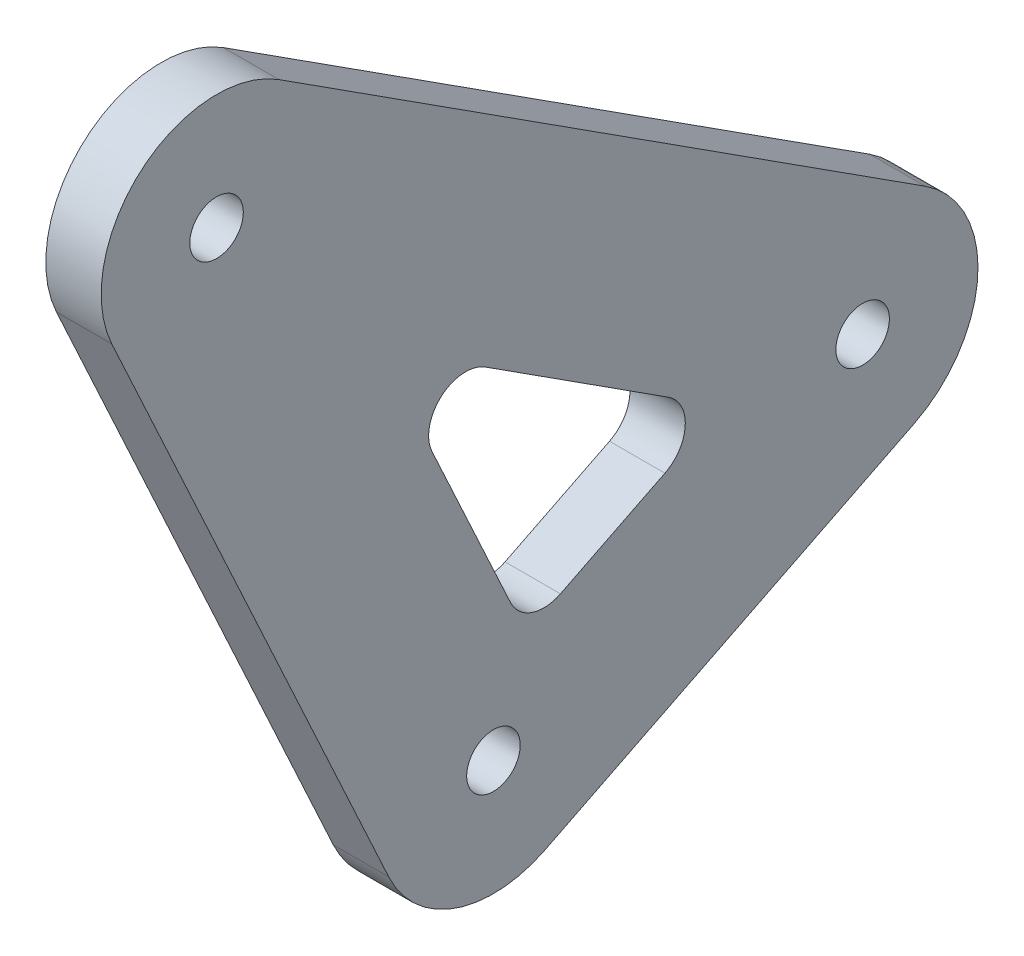
ISO-10303-21;
HEADER;
FILE_DESCRIPTION(('STEP AP214'),'2;1');
FILE_NAME('part.step','',(''),(''),'','','');
FILE_SCHEMA(('AUTOMOTIVE_DESIGN { 1 0 10303 214 1 1 1 1 }'));
ENDSEC;
DATA;
#1=APPLICATION_CONTEXT('core data for automotive mechanical design processes');
#2=APPLICATION_PROTOCOL_DEFINITION('international standard','automotive_design',2000,#1);
#3=PRODUCT_CONTEXT('',#1,'mechanical');
#4=PRODUCT('Part','Part','',(#3));
#5=PRODUCT_RELATED_PRODUCT_CATEGORY('part','',(#4));
#6=PRODUCT_DEFINITION_FORMATION('','',#4);
#7=PRODUCT_DEFINITION_CONTEXT('part definition',#1,'design');
#8=PRODUCT_DEFINITION('design','',#6,#7);
#9=PRODUCT_DEFINITION_SHAPE('','',#8);
#10=(LENGTH_UNIT() NAMED_UNIT(*) SI_UNIT(.MILLI.,.METRE.));
#11=(NAMED_UNIT(*) PLANE_ANGLE_UNIT() SI_UNIT($,.RADIAN.));
#12=(NAMED_UNIT(*) SI_UNIT($,.STERADIAN.) SOLID_ANGLE_UNIT());
#13=UNCERTAINTY_MEASURE_WITH_UNIT(LENGTH_MEASURE(1.E-05),#10,'distance_accuracy_value','');
#14=(GEOMETRIC_REPRESENTATION_CONTEXT(3) GLOBAL_UNCERTAINTY_ASSIGNED_CONTEXT((#13)) GLOBAL_UNIT_ASSIGNED_CONTEXT((#10,
#11,#12)) REPRESENTATION_CONTEXT('',''));
#15=CARTESIAN_POINT('',(0.,0.,0.));
#16=DIRECTION('',(0.,0.,1.));
#17=DIRECTION('',(1.,0.,0.));
#18=AXIS2_PLACEMENT_3D('',#15,#16,#17);
#19=CARTESIAN_POINT('',(1.5,10.000000011185,-20.));
#20=DIRECTION('',(-1.,0.,0.));
#21=DIRECTION('',(0.,0.,1.));
#22=AXIS2_PLACEMENT_3D('',#19,#20,#21);
#23=CYLINDRICAL_SURFACE('',#22,6.25);
#24=CARTESIAN_POINT('',(-1.5,10.000000011185,-20.));
#25=DIRECTION('',(1.,0.,0.));
#26=DIRECTION('',(0.,0.,-1.));
#27=AXIS2_PLACEMENT_3D('',#24,#25,#26);
#28=CIRCLE('',#27,6.25);
#29=CARTESIAN_POINT('',(-1.5,4.4098300686861,-22.7950849743758));
#30=VERTEX_POINT('',#29);
#31=CARTESIAN_POINT('',(-1.5,15.2573654830527,-23.3797349445205));
#32=VERTEX_POINT('',#31);
#33=EDGE_CURVE('E202',#30,#32,#28,.T.);
#34=ORIENTED_EDGE('',*,*,#33,.T.);
#35=DIRECTION('',(-1.,0.,0.));
#36=VECTOR('',#35,1.);
#37=CARTESIAN_POINT('',(1.5,15.2573654830527,-23.3797349445205));
#38=LINE('',#37,#36);
#39=CARTESIAN_POINT('',(1.5,15.2573654830527,-23.3797349445205));
#40=VERTEX_POINT('',#39);
#41=EDGE_CURVE('E11',#40,#32,#38,.T.);
#42=ORIENTED_EDGE('',*,*,#41,.F.);
#43=CARTESIAN_POINT('',(1.5,10.000000011185,-20.));
#44=DIRECTION('',(1.,0.,0.));
#45=DIRECTION('',(0.,0.,-1.));
#46=AXIS2_PLACEMENT_3D('',#43,#44,#45);
#47=CIRCLE('',#46,6.25);
#48=CARTESIAN_POINT('',(1.5,4.4098300686861,-22.7950849743758));
#49=VERTEX_POINT('',#48);
#50=EDGE_CURVE('E179',#49,#40,#47,.T.);
#51=ORIENTED_EDGE('',*,*,#50,.F.);
#52=DIRECTION('',(-1.,0.,0.));
#53=VECTOR('',#52,1.);
#54=CARTESIAN_POINT('',(1.5,4.4098300686861,-22.7950849743758));
#55=LINE('',#54,#53);
#56=EDGE_CURVE('E199',#49,#30,#55,.T.);
#57=ORIENTED_EDGE('',*,*,#56,.T.);
#58=EDGE_LOOP('',(#34,#42,#51,#57));
#59=FACE_BOUND('',#58,.T.);
#60=ADVANCED_FACE('F35',(#59),#23,.T.);
#61=CARTESIAN_POINT('',(1.5,21.4306506785176,-13.7768468579126));
#62=DIRECTION('',(0.,0.841178475498832,-0.540757591123288));
#63=DIRECTION('',(0.,0.540757591123288,0.841178475498832));
#64=AXIS2_PLACEMENT_3D('',#61,#62,#63);
#65=PLANE('',#64);
#66=DIRECTION('',(0.,-0.540757591123288,-0.841178475498832));
#67=VECTOR('',#66,1.);
#68=CARTESIAN_POINT('',(-1.5,21.4306506785176,-13.7768468579126));
#69=LINE('',#68,#67);
#70=CARTESIAN_POINT('',(-1.5,37.7573654718677,11.6202650554795));
#71=VERTEX_POINT('',#70);
#72=EDGE_CURVE('E205',#71,#32,#69,.T.);
#73=ORIENTED_EDGE('',*,*,#72,.F.);
#74=DIRECTION('',(-1.,0.,0.));
#75=VECTOR('',#74,1.);
#76=CARTESIAN_POINT('',(1.5,37.7573654718677,11.6202650554795));
#77=LINE('',#76,#75);
#78=CARTESIAN_POINT('',(1.5,37.7573654718677,11.6202650554795));
#79=VERTEX_POINT('',#78);
#80=EDGE_CURVE('E43',#79,#71,#77,.T.);
#81=ORIENTED_EDGE('',*,*,#80,.F.);
#82=DIRECTION('',(0.,-0.540757591123288,-0.841178475498832));
#83=VECTOR('',#82,1.);
#84=CARTESIAN_POINT('',(1.5,21.4306506785176,-13.7768468579126));
#85=LINE('',#84,#83);
#86=EDGE_CURVE('E182',#79,#40,#85,.T.);
#87=ORIENTED_EDGE('',*,*,#86,.T.);
#88=ORIENTED_EDGE('',*,*,#41,.T.);
#89=EDGE_LOOP('',(#73,#81,#87,#88));
#90=FACE_BOUND('',#89,.T.);
#91=ADVANCED_FACE('F244',(#90),#65,.T.);
#92=CARTESIAN_POINT('',(1.5,32.5,15.));
#93=DIRECTION('',(-1.,0.,0.));
#94=DIRECTION('',(0.,0.,1.));
#95=AXIS2_PLACEMENT_3D('',#92,#93,#94);
#96=CYLINDRICAL_SURFACE('',#95,6.25);
#97=CARTESIAN_POINT('',(-1.5,32.5,15.));
#98=DIRECTION('',(1.,0.,0.));
#99=DIRECTION('',(0.,0.,-1.));
#100=AXIS2_PLACEMENT_3D('',#97,#98,#99);
#101=CIRCLE('',#100,6.25);
#102=CARTESIAN_POINT('',(-1.5,29.8808863908641,20.6747461531278));
#103=VERTEX_POINT('',#102);
#104=EDGE_CURVE('E208',#71,#103,#101,.T.);
#105=ORIENTED_EDGE('',*,*,#104,.T.);
#106=DIRECTION('',(-1.,0.,0.));
#107=VECTOR('',#106,1.);
#108=CARTESIAN_POINT('',(1.5,29.8808863908641,20.6747461531278));
#109=LINE('',#108,#107);
#110=CARTESIAN_POINT('',(1.5,29.8808863908641,20.6747461531278));
#111=VERTEX_POINT('',#110);
#112=EDGE_CURVE('E229',#111,#103,#109,.T.);
#113=ORIENTED_EDGE('',*,*,#112,.F.);
#114=CARTESIAN_POINT('',(1.5,32.5,15.));
#115=DIRECTION('',(1.,0.,0.));
#116=DIRECTION('',(0.,0.,-1.));
#117=AXIS2_PLACEMENT_3D('',#114,#115,#116);
#118=CIRCLE('',#117,6.25);
#119=EDGE_CURVE('E185',#79,#111,#118,.T.);
#120=ORIENTED_EDGE('',*,*,#119,.F.);
#121=ORIENTED_EDGE('',*,*,#80,.T.);
#122=EDGE_LOOP('',(#105,#113,#120,#121));
#123=FACE_BOUND('',#122,.T.);
#124=ADVANCED_FACE('F234',(#123),#96,.T.);
#125=CARTESIAN_POINT('',(1.5,-2.61911360913592,5.67474615312783));
#126=DIRECTION('',(0.,0.419058177461747,-0.907959384500452));
#127=DIRECTION('',(0.,0.907959384500452,0.419058177461747));
#128=AXIS2_PLACEMENT_3D('',#125,#126,#127);
#129=PLANE('',#128);
#130=DIRECTION('',(0.,-0.907959384500452,-0.419058177461747));
#131=VECTOR('',#130,1.);
#132=CARTESIAN_POINT('',(-1.5,-2.61911360913592,5.67474615312783));
#133=LINE('',#132,#131);
#134=CARTESIAN_POINT('',(-1.5,-2.61911360913592,5.67474615312783));
#135=VERTEX_POINT('',#134);
#136=EDGE_CURVE('E210',#103,#135,#133,.T.);
#137=ORIENTED_EDGE('',*,*,#136,.T.);
#138=DIRECTION('',(-1.,0.,0.));
#139=VECTOR('',#138,1.);
#140=CARTESIAN_POINT('',(1.5,-2.61911360913592,5.67474615312783));
#141=LINE('',#140,#139);
#142=CARTESIAN_POINT('',(1.5,-2.61911360913592,5.67474615312783));
#143=VERTEX_POINT('',#142);
#144=EDGE_CURVE('E226',#143,#135,#141,.T.);
#145=ORIENTED_EDGE('',*,*,#144,.F.);
#146=DIRECTION('',(0.,-0.907959384500452,-0.419058177461747));
#147=VECTOR('',#146,1.);
#148=CARTESIAN_POINT('',(1.5,-2.61911360913592,5.67474615312783));
#149=LINE('',#148,#147);
#150=EDGE_CURVE('E187',#111,#143,#149,.T.);
#151=ORIENTED_EDGE('',*,*,#150,.F.);
#152=ORIENTED_EDGE('',*,*,#112,.T.);
#153=EDGE_LOOP('',(#137,#145,#151,#152));
#154=FACE_BOUND('',#153,.T.);
#155=ADVANCED_FACE('F260',(#154),#129,.F.);
#156=CARTESIAN_POINT('',(1.5,0.,0.));
#157=DIRECTION('',(-1.,0.,0.));
#158=DIRECTION('',(0.,0.,1.));
#159=AXIS2_PLACEMENT_3D('',#156,#157,#158);
#160=CYLINDRICAL_SURFACE('',#159,6.25);
#161=CARTESIAN_POINT('',(-1.5,0.,0.));
#162=DIRECTION('',(1.,0.,0.));
#163=DIRECTION('',(0.,0.,-1.));
#164=AXIS2_PLACEMENT_3D('',#161,#162,#163);
#165=CIRCLE('',#164,6.25);
#166=CARTESIAN_POINT('',(-1.5,-5.59016994249895,-2.79508497437579));
#167=VERTEX_POINT('',#166);
#168=EDGE_CURVE('E212',#135,#167,#165,.T.);
#169=ORIENTED_EDGE('',*,*,#168,.T.);
#170=DIRECTION('',(-1.,0.,0.));
#171=VECTOR('',#170,1.);
#172=CARTESIAN_POINT('',(1.5,-5.59016994249895,-2.79508497437579));
#173=LINE('',#172,#171);
#174=CARTESIAN_POINT('',(1.5,-5.59016994249895,-2.79508497437579));
#175=VERTEX_POINT('',#174);
#176=EDGE_CURVE('E223',#175,#167,#173,.T.);
#177=ORIENTED_EDGE('',*,*,#176,.F.);
#178=CARTESIAN_POINT('',(1.5,0.,0.));
#179=DIRECTION('',(1.,0.,0.));
#180=DIRECTION('',(0.,0.,-1.));
#181=AXIS2_PLACEMENT_3D('',#178,#179,#180);
#182=CIRCLE('',#181,6.25);
#183=EDGE_CURVE('E189',#143,#175,#182,.T.);
#184=ORIENTED_EDGE('',*,*,#183,.F.);
#185=ORIENTED_EDGE('',*,*,#144,.T.);
#186=EDGE_LOOP('',(#169,#177,#184,#185));
#187=FACE_BOUND('',#186,.T.);
#188=ADVANCED_FACE('F256',(#187),#160,.T.);
#189=CARTESIAN_POINT('',(1.5,32.5,15.));
#190=DIRECTION('',(-1.,0.,0.));
#191=DIRECTION('',(0.,0.,1.));
#192=AXIS2_PLACEMENT_3D('',#189,#190,#191);
#193=CYLINDRICAL_SURFACE('',#192,1.45);
#194=CARTESIAN_POINT('',(1.5,32.5,15.));
#195=DIRECTION('',(1.,0.,0.));
#196=DIRECTION('',(0.,0.,-1.));
#197=AXIS2_PLACEMENT_3D('',#194,#195,#196);
#198=CIRCLE('',#197,1.45);
#199=CARTESIAN_POINT('',(1.5,32.5,13.55));
#200=VERTEX_POINT('',#199);
#201=EDGE_CURVE('E193',#200,#200,#198,.T.);
#202=ORIENTED_EDGE('',*,*,#201,.T.);
#203=EDGE_LOOP('',(#202));
#204=FACE_BOUND('',#203,.T.);
#205=CARTESIAN_POINT('',(-1.5,32.5,15.));
#206=DIRECTION('',(1.,0.,0.));
#207=DIRECTION('',(0.,0.,-1.));
#208=AXIS2_PLACEMENT_3D('',#205,#206,#207);
#209=CIRCLE('',#208,1.45);
#210=CARTESIAN_POINT('',(-1.5,32.5,13.55));
#211=VERTEX_POINT('',#210);
#212=EDGE_CURVE('E216',#211,#211,#209,.T.);
#213=ORIENTED_EDGE('',*,*,#212,.F.);
#214=EDGE_LOOP('',(#213));
#215=FACE_BOUND('',#214,.T.);
#216=ADVANCED_FACE('F296',(#204,#215),#193,.F.);
#217=CARTESIAN_POINT('',(1.5,-5.59016994249895,-2.79508497437579));
#218=DIRECTION('',(0.,0.894427190799832,0.447213595900126));
#219=DIRECTION('',(0.,-0.447213595900126,0.894427190799832));
#220=AXIS2_PLACEMENT_3D('',#217,#218,#219);
#221=PLANE('',#220);
#222=DIRECTION('',(0.,0.447213595900126,-0.894427190799832));
#223=VECTOR('',#222,1.);
#224=CARTESIAN_POINT('',(-1.5,-5.59016994249895,-2.79508497437579));
#225=LINE('',#224,#223);
#226=EDGE_CURVE('E214',#167,#30,#225,.T.);
#227=ORIENTED_EDGE('',*,*,#226,.T.);
#228=ORIENTED_EDGE('',*,*,#56,.F.);
#229=DIRECTION('',(0.,0.447213595900126,-0.894427190799832));
#230=VECTOR('',#229,1.);
#231=CARTESIAN_POINT('',(1.5,-5.59016994249895,-2.79508497437579));
#232=LINE('',#231,#230);
#233=EDGE_CURVE('E191',#175,#49,#232,.T.);
#234=ORIENTED_EDGE('',*,*,#233,.F.);
#235=ORIENTED_EDGE('',*,*,#176,.T.);
#236=EDGE_LOOP('',(#227,#228,#234,#235));
#237=FACE_BOUND('',#236,.T.);
#238=ADVANCED_FACE('F251',(#237),#221,.F.);
#239=CARTESIAN_POINT('',(1.5,10.000000011185,-20.));
#240=DIRECTION('',(-1.,0.,0.));
#241=DIRECTION('',(0.,0.,1.));
#242=AXIS2_PLACEMENT_3D('',#239,#240,#241);
#243=CYLINDRICAL_SURFACE('',#242,1.45);
#244=CARTESIAN_POINT('',(1.5,10.000000011185,-20.));
#245=DIRECTION('',(1.,0.,0.));
#246=DIRECTION('',(0.,0.,-1.));
#247=AXIS2_PLACEMENT_3D('',#244,#245,#246);
#248=CIRCLE('',#247,1.45);
#249=CARTESIAN_POINT('',(1.5,10.000000011185,-21.45));
#250=VERTEX_POINT('',#249);
#251=EDGE_CURVE('E176',#250,#250,#248,.T.);
#252=ORIENTED_EDGE('',*,*,#251,.T.);
#253=EDGE_LOOP('',(#252));
#254=FACE_BOUND('',#253,.T.);
#255=CARTESIAN_POINT('',(-1.5,10.000000011185,-20.));
#256=DIRECTION('',(1.,0.,0.));
#257=DIRECTION('',(0.,0.,-1.));
#258=AXIS2_PLACEMENT_3D('',#255,#256,#257);
#259=CIRCLE('',#258,1.45);
#260=CARTESIAN_POINT('',(-1.5,10.000000011185,-21.45));
#261=VERTEX_POINT('',#260);
#262=EDGE_CURVE('E168',#261,#261,#259,.T.);
#263=ORIENTED_EDGE('',*,*,#262,.F.);
#264=EDGE_LOOP('',(#263));
#265=FACE_BOUND('',#264,.T.);
#266=ADVANCED_FACE('F37',(#254,#265),#243,.F.);
#267=CARTESIAN_POINT('',(1.5,0.,0.));
#268=DIRECTION('',(-1.,0.,0.));
#269=DIRECTION('',(0.,0.,1.));
#270=AXIS2_PLACEMENT_3D('',#267,#268,#269);
#271=CYLINDRICAL_SURFACE('',#270,1.45);
#272=CARTESIAN_POINT('',(1.5,0.,0.));
#273=DIRECTION('',(1.,0.,0.));
#274=DIRECTION('',(0.,0.,-1.));
#275=AXIS2_PLACEMENT_3D('',#272,#273,#274);
#276=CIRCLE('',#275,1.45);
#277=CARTESIAN_POINT('',(1.5,0.,-1.45));
#278=VERTEX_POINT('',#277);
#279=EDGE_CURVE('E196',#278,#278,#276,.T.);
#280=ORIENTED_EDGE('',*,*,#279,.T.);
#281=EDGE_LOOP('',(#280));
#282=FACE_BOUND('',#281,.T.);
#283=CARTESIAN_POINT('',(-1.5,0.,0.));
#284=DIRECTION('',(1.,0.,0.));
#285=DIRECTION('',(0.,0.,-1.));
#286=AXIS2_PLACEMENT_3D('',#283,#284,#285);
#287=CIRCLE('',#286,1.45);
#288=CARTESIAN_POINT('',(-1.5,0.,-1.45));
#289=VERTEX_POINT('',#288);
#290=EDGE_CURVE('E180',#289,#289,#287,.T.);
#291=ORIENTED_EDGE('',*,*,#290,.F.);
#292=EDGE_LOOP('',(#291));
#293=FACE_BOUND('',#292,.T.);
#294=ADVANCED_FACE('F265',(#282,#293),#271,.F.);
#295=CARTESIAN_POINT('',(1.5,0.,0.));
#296=DIRECTION('',(1.,0.,0.));
#297=DIRECTION('',(0.,0.,-1.));
#298=AXIS2_PLACEMENT_3D('',#295,#296,#297);
#299=PLANE('',#298);
#300=CARTESIAN_POINT('',(1.5,10.6255451701964,-8.39369945750439));
#301=DIRECTION('',(1.,0.,0.));
#302=DIRECTION('',(0.,0.,-1.));
#303=AXIS2_PLACEMENT_3D('',#300,#301,#302);
#304=CIRCLE('',#303,2.);
#305=CARTESIAN_POINT('',(1.5,8.83669078859672,-9.28812664930462));
#306=VERTEX_POINT('',#305);
#307=CARTESIAN_POINT('',(1.5,12.3079021211941,-9.47521463975095));
#308=VERTEX_POINT('',#307);
#309=EDGE_CURVE('E50',#306,#308,#304,.T.);
#310=ORIENTED_EDGE('',*,*,#309,.F.);
#311=DIRECTION('',(0.,0.447213595900126,-0.894427190799832));
#312=VECTOR('',#311,1.);
#313=CARTESIAN_POINT('',(1.5,6.00719413430982,-3.62913334706043));
#314=LINE('',#313,#312);
#315=CARTESIAN_POINT('',(1.5,6.00719413430982,-3.62913334706043));
#316=VERTEX_POINT('',#315);
#317=EDGE_CURVE('E142',#316,#306,#314,.T.);
#318=ORIENTED_EDGE('',*,*,#317,.F.);
#319=CARTESIAN_POINT('',(1.5,7.79604851590947,-2.73470615526016));
#320=DIRECTION('',(1.,0.,0.));
#321=DIRECTION('',(0.,0.,1.));
#322=AXIS2_PLACEMENT_3D('',#319,#320,#321);
#323=CIRCLE('',#322,2.);
#324=CARTESIAN_POINT('',(1.5,6.95793216098599,-0.918787386259253));
#325=VERTEX_POINT('',#324);
#326=EDGE_CURVE('E145',#325,#316,#323,.T.);
#327=ORIENTED_EDGE('',*,*,#326,.F.);
#328=DIRECTION('',(0.,-0.907959384500452,-0.419058177461747));
#329=VECTOR('',#328,1.);
#330=CARTESIAN_POINT('',(1.5,16.1537962771328,3.32545759042388));
#331=LINE('',#330,#329);
#332=CARTESIAN_POINT('',(1.5,16.1537962771328,3.32545759042388));
#333=VERTEX_POINT('',#332);
#334=EDGE_CURVE('E161',#333,#325,#331,.T.);
#335=ORIENTED_EDGE('',*,*,#334,.F.);
#336=CARTESIAN_POINT('',(1.5,16.9919126320563,1.50953882142301));
#337=DIRECTION('',(1.,0.,0.));
#338=DIRECTION('',(0.,0.,1.));
#339=AXIS2_PLACEMENT_3D('',#336,#337,#338);
#340=CIRCLE('',#339,2.);
#341=CARTESIAN_POINT('',(1.5,18.674269583054,0.42802363917636));
#342=VERTEX_POINT('',#341);
#343=EDGE_CURVE('E158',#342,#333,#340,.T.);
#344=ORIENTED_EDGE('',*,*,#343,.F.);
#345=DIRECTION('',(0.,0.540757591123288,0.841178475498832));
#346=VECTOR('',#345,1.);
#347=CARTESIAN_POINT('',(1.5,12.3079021211941,-9.47521463975095));
#348=LINE('',#347,#346);
#349=EDGE_CURVE('E156',#308,#342,#348,.T.);
#350=ORIENTED_EDGE('',*,*,#349,.F.);
#351=EDGE_LOOP('',(#310,#318,#327,#335,#344,#350));
#352=FACE_BOUND('',#351,.T.);
#353=ORIENTED_EDGE('',*,*,#251,.F.);
#354=EDGE_LOOP('',(#353));
#355=FACE_BOUND('',#354,.T.);
#356=ORIENTED_EDGE('',*,*,#50,.T.);
#357=ORIENTED_EDGE('',*,*,#86,.F.);
#358=ORIENTED_EDGE('',*,*,#119,.T.);
#359=ORIENTED_EDGE('',*,*,#150,.T.);
#360=ORIENTED_EDGE('',*,*,#183,.T.);
#361=ORIENTED_EDGE('',*,*,#233,.T.);
#362=EDGE_LOOP('',(#356,#357,#358,#359,#360,#361));
#363=FACE_BOUND('',#362,.T.);
#364=ORIENTED_EDGE('',*,*,#201,.F.);
#365=EDGE_LOOP('',(#364));
#366=FACE_BOUND('',#365,.T.);
#367=ORIENTED_EDGE('',*,*,#279,.F.);
#368=EDGE_LOOP('',(#367));
#369=FACE_BOUND('',#368,.T.);
#370=ADVANCED_FACE('F262',(#352,#355,#363,#366,#369),#299,.T.);
#371=CARTESIAN_POINT('',(-1.5,0.,0.));
#372=DIRECTION('',(1.,0.,0.));
#373=DIRECTION('',(0.,0.,-1.));
#374=AXIS2_PLACEMENT_3D('',#371,#372,#373);
#375=PLANE('',#374);
#376=DIRECTION('',(0.,0.447213595900126,-0.894427190799832));
#377=VECTOR('',#376,1.);
#378=CARTESIAN_POINT('',(-1.5,6.00719413430982,-3.62913334706043));
#379=LINE('',#378,#377);
#380=CARTESIAN_POINT('',(-1.5,6.00719413430982,-3.62913334706043));
#381=VERTEX_POINT('',#380);
#382=CARTESIAN_POINT('',(-1.5,8.83669078859672,-9.28812664930462));
#383=VERTEX_POINT('',#382);
#384=EDGE_CURVE('E131',#381,#383,#379,.T.);
#385=ORIENTED_EDGE('',*,*,#384,.T.);
#386=CARTESIAN_POINT('',(-1.5,10.6255451701964,-8.39369945750439));
#387=DIRECTION('',(1.,0.,0.));
#388=DIRECTION('',(0.,0.,-1.));
#389=AXIS2_PLACEMENT_3D('',#386,#387,#388);
#390=CIRCLE('',#389,2.);
#391=CARTESIAN_POINT('',(-1.5,12.3079021211941,-9.47521463975095));
#392=VERTEX_POINT('',#391);
#393=EDGE_CURVE('E125',#383,#392,#390,.T.);
#394=ORIENTED_EDGE('',*,*,#393,.T.);
#395=DIRECTION('',(0.,0.540757591123288,0.841178475498832));
#396=VECTOR('',#395,1.);
#397=CARTESIAN_POINT('',(-1.5,12.3079021211941,-9.47521463975095));
#398=LINE('',#397,#396);
#399=CARTESIAN_POINT('',(-1.5,18.674269583054,0.428023639176361));
#400=VERTEX_POINT('',#399);
#401=EDGE_CURVE('E134',#392,#400,#398,.T.);
#402=ORIENTED_EDGE('',*,*,#401,.T.);
#403=CARTESIAN_POINT('',(-1.5,16.9919126320563,1.50953882142301));
#404=DIRECTION('',(1.,0.,0.));
#405=DIRECTION('',(0.,0.,1.));
#406=AXIS2_PLACEMENT_3D('',#403,#404,#405);
#407=CIRCLE('',#406,2.);
#408=CARTESIAN_POINT('',(-1.5,16.1537962771328,3.32545759042388));
#409=VERTEX_POINT('',#408);
#410=EDGE_CURVE('E58',#400,#409,#407,.T.);
#411=ORIENTED_EDGE('',*,*,#410,.T.);
#412=DIRECTION('',(0.,-0.907959384500452,-0.419058177461747));
#413=VECTOR('',#412,1.);
#414=CARTESIAN_POINT('',(-1.5,16.1537962771328,3.32545759042388));
#415=LINE('',#414,#413);
#416=CARTESIAN_POINT('',(-1.5,6.95793216098599,-0.918787386259253));
#417=VERTEX_POINT('',#416);
#418=EDGE_CURVE('E149',#409,#417,#415,.T.);
#419=ORIENTED_EDGE('',*,*,#418,.T.);
#420=CARTESIAN_POINT('',(-1.5,7.79604851590947,-2.73470615526016));
#421=DIRECTION('',(1.,0.,0.));
#422=DIRECTION('',(0.,0.,1.));
#423=AXIS2_PLACEMENT_3D('',#420,#421,#422);
#424=CIRCLE('',#423,2.);
#425=EDGE_CURVE('E152',#417,#381,#424,.T.);
#426=ORIENTED_EDGE('',*,*,#425,.T.);
#427=EDGE_LOOP('',(#385,#394,#402,#411,#419,#426));
#428=FACE_BOUND('',#427,.T.);
#429=ORIENTED_EDGE('',*,*,#262,.T.);
#430=EDGE_LOOP('',(#429));
#431=FACE_BOUND('',#430,.T.);
#432=ORIENTED_EDGE('',*,*,#33,.F.);
#433=ORIENTED_EDGE('',*,*,#226,.F.);
#434=ORIENTED_EDGE('',*,*,#168,.F.);
#435=ORIENTED_EDGE('',*,*,#136,.F.);
#436=ORIENTED_EDGE('',*,*,#104,.F.);
#437=ORIENTED_EDGE('',*,*,#72,.T.);
#438=EDGE_LOOP('',(#432,#433,#434,#435,#436,#437));
#439=FACE_BOUND('',#438,.T.);
#440=ORIENTED_EDGE('',*,*,#212,.T.);
#441=EDGE_LOOP('',(#440));
#442=FACE_BOUND('',#441,.T.);
#443=ORIENTED_EDGE('',*,*,#290,.T.);
#444=EDGE_LOOP('',(#443));
#445=FACE_BOUND('',#444,.T.);
#446=ADVANCED_FACE('F138',(#428,#431,#439,#442,#445),#375,.F.);
#447=CARTESIAN_POINT('',(-1.5,10.6255451701964,-8.39369945750439));
#448=DIRECTION('',(1.,0.,0.));
#449=DIRECTION('',(0.,0.,-1.));
#450=AXIS2_PLACEMENT_3D('',#447,#448,#449);
#451=CYLINDRICAL_SURFACE('',#450,2.);
#452=ORIENTED_EDGE('',*,*,#309,.T.);
#453=DIRECTION('',(1.,0.,0.));
#454=VECTOR('',#453,1.);
#455=CARTESIAN_POINT('',(-1.5,12.3079021211941,-9.47521463975095));
#456=LINE('',#455,#454);
#457=EDGE_CURVE('E121',#392,#308,#456,.T.);
#458=ORIENTED_EDGE('',*,*,#457,.F.);
#459=ORIENTED_EDGE('',*,*,#393,.F.);
#460=DIRECTION('',(1.,0.,0.));
#461=VECTOR('',#460,1.);
#462=CARTESIAN_POINT('',(-1.5,8.83669078859672,-9.28812664930462));
#463=LINE('',#462,#461);
#464=EDGE_CURVE('E166',#383,#306,#463,.T.);
#465=ORIENTED_EDGE('',*,*,#464,.T.);
#466=EDGE_LOOP('',(#452,#458,#459,#465));
#467=FACE_BOUND('',#466,.T.);
#468=ADVANCED_FACE('F123',(#467),#451,.F.);
#469=CARTESIAN_POINT('',(-1.5,6.00719413430982,-3.62913334706043));
#470=DIRECTION('',(0.,-0.894427190799832,-0.447213595900126));
#471=DIRECTION('',(0.,0.447213595900126,-0.894427190799832));
#472=AXIS2_PLACEMENT_3D('',#469,#470,#471);
#473=PLANE('',#472);
#474=ORIENTED_EDGE('',*,*,#317,.T.);
#475=ORIENTED_EDGE('',*,*,#464,.F.);
#476=ORIENTED_EDGE('',*,*,#384,.F.);
#477=DIRECTION('',(1.,0.,0.));
#478=VECTOR('',#477,1.);
#479=CARTESIAN_POINT('',(-1.5,6.00719413430982,-3.62913334706043));
#480=LINE('',#479,#478);
#481=EDGE_CURVE('E169',#381,#316,#480,.T.);
#482=ORIENTED_EDGE('',*,*,#481,.T.);
#483=EDGE_LOOP('',(#474,#475,#476,#482));
#484=FACE_BOUND('',#483,.T.);
#485=ADVANCED_FACE('F282',(#484),#473,.F.);
#486=CARTESIAN_POINT('',(-1.5,7.79604851590947,-2.73470615526016));
#487=DIRECTION('',(1.,0.,0.));
#488=DIRECTION('',(0.,0.,-1.));
#489=AXIS2_PLACEMENT_3D('',#486,#487,#488);
#490=CYLINDRICAL_SURFACE('',#489,2.);
#491=ORIENTED_EDGE('',*,*,#326,.T.);
#492=ORIENTED_EDGE('',*,*,#481,.F.);
#493=ORIENTED_EDGE('',*,*,#425,.F.);
#494=DIRECTION('',(1.,0.,0.));
#495=VECTOR('',#494,1.);
#496=CARTESIAN_POINT('',(-1.5,6.95793216098599,-0.918787386259253));
#497=LINE('',#496,#495);
#498=EDGE_CURVE('E171',#417,#325,#497,.T.);
#499=ORIENTED_EDGE('',*,*,#498,.T.);
#500=EDGE_LOOP('',(#491,#492,#493,#499));
#501=FACE_BOUND('',#500,.T.);
#502=ADVANCED_FACE('F347',(#501),#490,.F.);
#503=CARTESIAN_POINT('',(-1.5,16.1537962771328,3.32545759042388));
#504=DIRECTION('',(0.,-0.419058177461747,0.907959384500452));
#505=DIRECTION('',(0.,-0.907959384500452,-0.419058177461747));
#506=AXIS2_PLACEMENT_3D('',#503,#504,#505);
#507=PLANE('',#506);
#508=ORIENTED_EDGE('',*,*,#334,.T.);
#509=ORIENTED_EDGE('',*,*,#498,.F.);
#510=ORIENTED_EDGE('',*,*,#418,.F.);
#511=DIRECTION('',(1.,0.,0.));
#512=VECTOR('',#511,1.);
#513=CARTESIAN_POINT('',(-1.5,16.1537962771328,3.32545759042388));
#514=LINE('',#513,#512);
#515=EDGE_CURVE('E173',#409,#333,#514,.T.);
#516=ORIENTED_EDGE('',*,*,#515,.T.);
#517=EDGE_LOOP('',(#508,#509,#510,#516));
#518=FACE_BOUND('',#517,.T.);
#519=ADVANCED_FACE('F357',(#518),#507,.F.);
#520=CARTESIAN_POINT('',(-1.5,16.9919126320563,1.50953882142301));
#521=DIRECTION('',(1.,0.,0.));
#522=DIRECTION('',(0.,0.,-1.));
#523=AXIS2_PLACEMENT_3D('',#520,#521,#522);
#524=CYLINDRICAL_SURFACE('',#523,2.);
#525=ORIENTED_EDGE('',*,*,#343,.T.);
#526=ORIENTED_EDGE('',*,*,#515,.F.);
#527=ORIENTED_EDGE('',*,*,#410,.F.);
#528=DIRECTION('',(1.,0.,0.));
#529=VECTOR('',#528,1.);
#530=CARTESIAN_POINT('',(-1.5,18.674269583054,0.42802363917636));
#531=LINE('',#530,#529);
#532=EDGE_CURVE('E130',#400,#342,#531,.T.);
#533=ORIENTED_EDGE('',*,*,#532,.T.);
#534=EDGE_LOOP('',(#525,#526,#527,#533));
#535=FACE_BOUND('',#534,.T.);
#536=ADVANCED_FACE('F367',(#535),#524,.F.);
#537=CARTESIAN_POINT('',(-1.5,12.3079021211941,-9.47521463975095));
#538=DIRECTION('',(0.,0.841178475498832,-0.540757591123288));
#539=DIRECTION('',(0.,0.540757591123288,0.841178475498832));
#540=AXIS2_PLACEMENT_3D('',#537,#538,#539);
#541=PLANE('',#540);
#542=ORIENTED_EDGE('',*,*,#349,.T.);
#543=ORIENTED_EDGE('',*,*,#532,.F.);
#544=ORIENTED_EDGE('',*,*,#401,.F.);
#545=ORIENTED_EDGE('',*,*,#457,.T.);
#546=EDGE_LOOP('',(#542,#543,#544,#545));
#547=FACE_BOUND('',#546,.T.);
#548=ADVANCED_FACE('F135',(#547),#541,.F.);
#549=CLOSED_SHELL('',(#60,#91,#124,#155,#188,#216,#238,#266,#294,#370,#446,#468,#485,#502,#519,
#536,#548));
#550=MANIFOLD_SOLID_BREP('B2',#549);
#551=ADVANCED_BREP_SHAPE_REPRESENTATION('',(#18,#550),#14);
#552=SHAPE_DEFINITION_REPRESENTATION(#9,#551);
ENDSEC;
END-ISO-10303-21;
